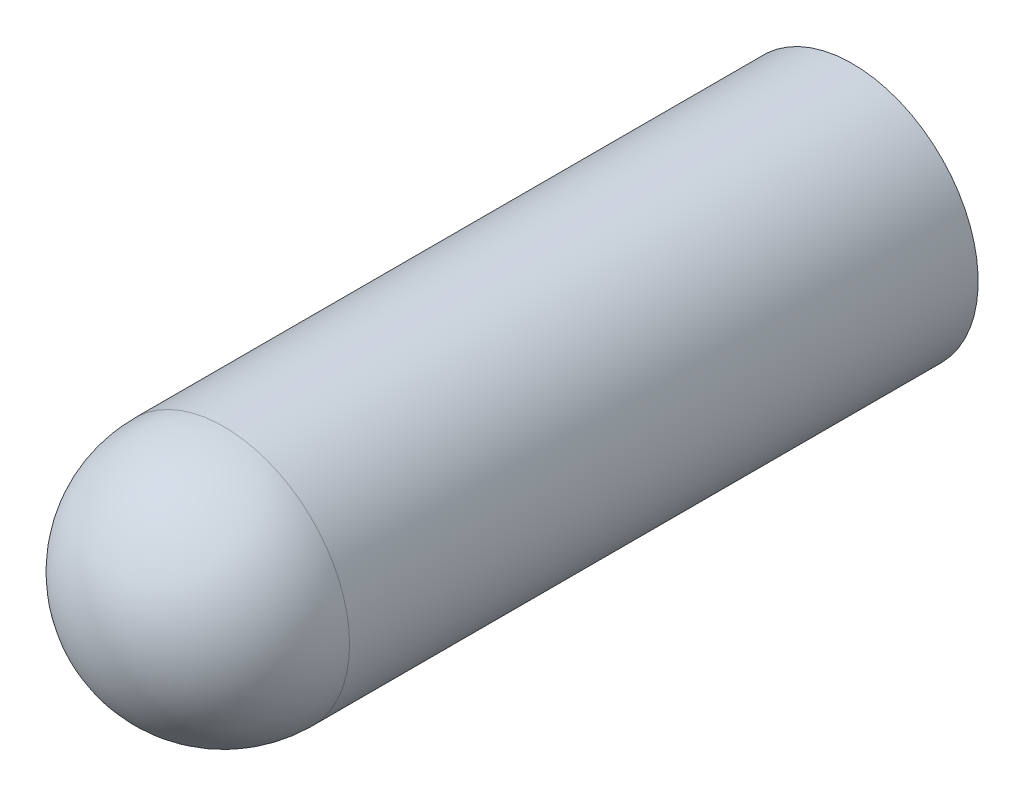
ISO-10303-21;
HEADER;
FILE_DESCRIPTION(('STEP AP214'),'2;1');
FILE_NAME('part.step','',(''),(''),'','','');
FILE_SCHEMA(('AUTOMOTIVE_DESIGN { 1 0 10303 214 1 1 1 1 }'));
ENDSEC;
DATA;
#1=APPLICATION_CONTEXT('core data for automotive mechanical design processes');
#2=APPLICATION_PROTOCOL_DEFINITION('international standard','automotive_design',2000,#1);
#3=PRODUCT_CONTEXT('',#1,'mechanical');
#4=PRODUCT('Part','Part','',(#3));
#5=PRODUCT_RELATED_PRODUCT_CATEGORY('part','',(#4));
#6=PRODUCT_DEFINITION_FORMATION('','',#4);
#7=PRODUCT_DEFINITION_CONTEXT('part definition',#1,'design');
#8=PRODUCT_DEFINITION('design','',#6,#7);
#9=PRODUCT_DEFINITION_SHAPE('','',#8);
#10=(LENGTH_UNIT() NAMED_UNIT(*) SI_UNIT(.MILLI.,.METRE.));
#11=(NAMED_UNIT(*) PLANE_ANGLE_UNIT() SI_UNIT($,.RADIAN.));
#12=(NAMED_UNIT(*) SI_UNIT($,.STERADIAN.) SOLID_ANGLE_UNIT());
#13=UNCERTAINTY_MEASURE_WITH_UNIT(LENGTH_MEASURE(1.E-05),#10,'distance_accuracy_value','');
#14=(GEOMETRIC_REPRESENTATION_CONTEXT(3) GLOBAL_UNCERTAINTY_ASSIGNED_CONTEXT((#13)) GLOBAL_UNIT_ASSIGNED_CONTEXT((#10,
#11,#12)) REPRESENTATION_CONTEXT('',''));
#15=CARTESIAN_POINT('',(0.,0.,0.));
#16=DIRECTION('',(0.,0.,1.));
#17=DIRECTION('',(1.,0.,0.));
#18=AXIS2_PLACEMENT_3D('',#15,#16,#17);
#19=CARTESIAN_POINT('',(-13.843,-20.6375,30.3012));
#20=DIRECTION('',(0.,0.,-1.));
#21=DIRECTION('',(-1.,0.,0.));
#22=AXIS2_PLACEMENT_3D('',#19,#20,#21);
#23=CYLINDRICAL_SURFACE('',#22,1.);
#24=CARTESIAN_POINT('',(-13.843,-20.6375,29.3012));
#25=DIRECTION('',(0.,0.,-1.));
#26=DIRECTION('',(-1.,0.,0.));
#27=AXIS2_PLACEMENT_3D('',#24,#25,#26);
#28=CIRCLE('',#27,1.);
#29=CARTESIAN_POINT('',(-14.843,-20.6375,29.3012));
#30=VERTEX_POINT('',#29);
#31=EDGE_CURVE('E10',#30,#30,#28,.T.);
#32=ORIENTED_EDGE('',*,*,#31,.T.);
#33=EDGE_LOOP('',(#32));
#34=FACE_BOUND('',#33,.T.);
#35=CARTESIAN_POINT('',(-13.843,-20.6375,24.3012));
#36=DIRECTION('',(0.,0.,-1.));
#37=DIRECTION('',(-1.,0.,0.));
#38=AXIS2_PLACEMENT_3D('',#35,#36,#37);
#39=CIRCLE('',#38,1.);
#40=CARTESIAN_POINT('',(-14.843,-20.6375,24.3012));
#41=VERTEX_POINT('',#40);
#42=EDGE_CURVE('E49',#41,#41,#39,.T.);
#43=ORIENTED_EDGE('',*,*,#42,.F.);
#44=EDGE_LOOP('',(#43));
#45=FACE_BOUND('',#44,.T.);
#46=ADVANCED_FACE('F43',(#34,#45),#23,.T.);
#47=CARTESIAN_POINT('',(0.,-19.05,24.3012));
#48=DIRECTION('',(0.,0.,1.));
#49=DIRECTION('',(1.,0.,0.));
#50=AXIS2_PLACEMENT_3D('',#47,#48,#49);
#51=PLANE('',#50);
#52=ORIENTED_EDGE('',*,*,#42,.T.);
#53=EDGE_LOOP('',(#52));
#54=FACE_BOUND('',#53,.T.);
#55=ADVANCED_FACE('F55',(#54),#51,.F.);
#56=CARTESIAN_POINT('',(-13.843,-20.6375,29.3012));
#57=DIRECTION('',(0.,0.,1.));
#58=DIRECTION('',(1.,0.,0.));
#59=AXIS2_PLACEMENT_3D('',#56,#57,#58);
#60=SPHERICAL_SURFACE('',#59,1.);
#61=ORIENTED_EDGE('',*,*,#31,.F.);
#62=EDGE_LOOP('',(#61));
#63=FACE_BOUND('',#62,.T.);
#64=ADVANCED_FACE('F61',(#63),#60,.T.);
#65=CLOSED_SHELL('',(#46,#55,#64));
#66=MANIFOLD_SOLID_BREP('B2',#65);
#67=ADVANCED_BREP_SHAPE_REPRESENTATION('',(#18,#66),#14);
#68=SHAPE_DEFINITION_REPRESENTATION(#9,#67);
ENDSEC;
END-ISO-10303-21;
